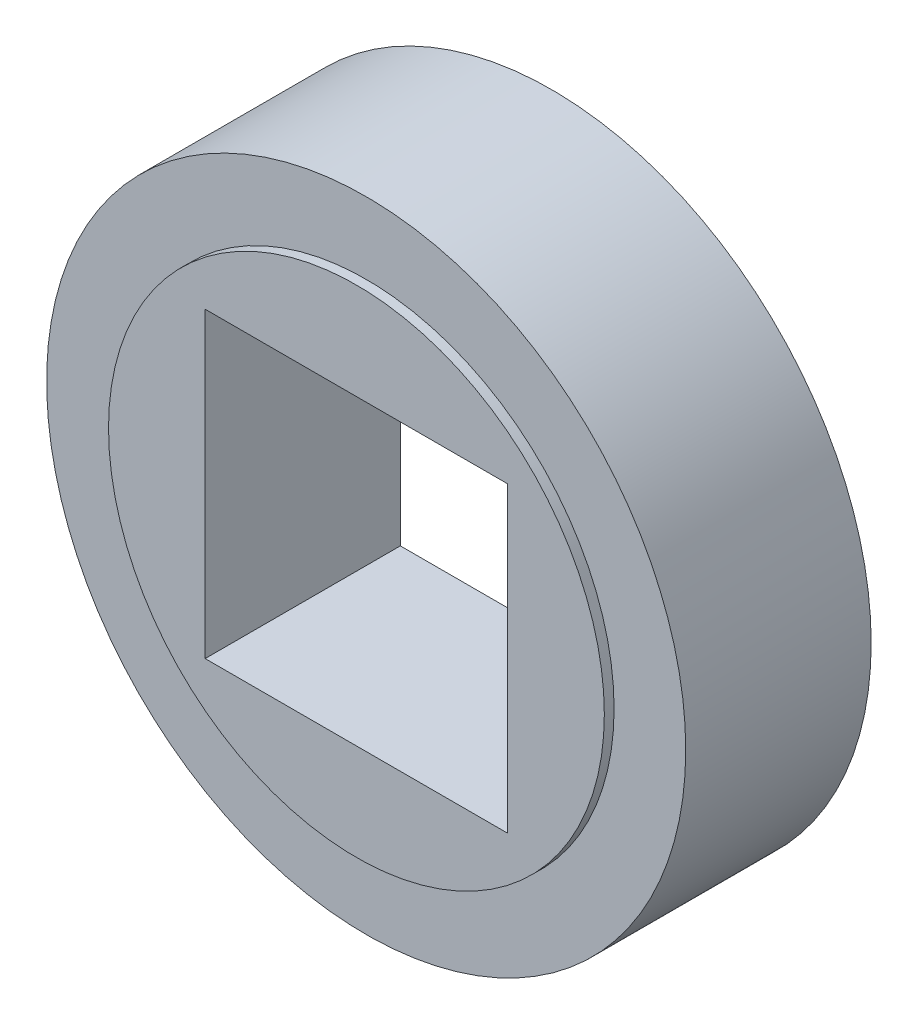
ISO-10303-21;
HEADER;
FILE_DESCRIPTION(('STEP AP214'),'2;1');
FILE_NAME('part.step','',(''),(''),'','','');
FILE_SCHEMA(('AUTOMOTIVE_DESIGN { 1 0 10303 214 1 1 1 1 }'));
ENDSEC;
DATA;
#1=APPLICATION_CONTEXT('core data for automotive mechanical design processes');
#2=APPLICATION_PROTOCOL_DEFINITION('international standard','automotive_design',2000,#1);
#3=PRODUCT_CONTEXT('',#1,'mechanical');
#4=PRODUCT('Part','Part','',(#3));
#5=PRODUCT_RELATED_PRODUCT_CATEGORY('part','',(#4));
#6=PRODUCT_DEFINITION_FORMATION('','',#4);
#7=PRODUCT_DEFINITION_CONTEXT('part definition',#1,'design');
#8=PRODUCT_DEFINITION('design','',#6,#7);
#9=PRODUCT_DEFINITION_SHAPE('','',#8);
#10=(LENGTH_UNIT() NAMED_UNIT(*) SI_UNIT(.MILLI.,.METRE.));
#11=(NAMED_UNIT(*) PLANE_ANGLE_UNIT() SI_UNIT($,.RADIAN.));
#12=(NAMED_UNIT(*) SI_UNIT($,.STERADIAN.) SOLID_ANGLE_UNIT());
#13=UNCERTAINTY_MEASURE_WITH_UNIT(LENGTH_MEASURE(1.E-05),#10,'distance_accuracy_value','');
#14=(GEOMETRIC_REPRESENTATION_CONTEXT(3) GLOBAL_UNCERTAINTY_ASSIGNED_CONTEXT((#13)) GLOBAL_UNIT_ASSIGNED_CONTEXT((#10,
#11,#12)) REPRESENTATION_CONTEXT('',''));
#15=CARTESIAN_POINT('',(0.,0.,0.));
#16=DIRECTION('',(0.,0.,1.));
#17=DIRECTION('',(1.,0.,0.));
#18=AXIS2_PLACEMENT_3D('',#15,#16,#17);
#19=CARTESIAN_POINT('',(0.,0.,20.));
#20=DIRECTION('',(0.,0.,1.));
#21=DIRECTION('',(1.,0.,0.));
#22=AXIS2_PLACEMENT_3D('',#19,#20,#21);
#23=PLANE('',#22);
#24=DIRECTION('',(1.,0.,0.));
#25=VECTOR('',#24,1.);
#26=CARTESIAN_POINT('',(15.5,-15.5,20.));
#27=LINE('',#26,#25);
#28=CARTESIAN_POINT('',(-15.5,-15.5,20.));
#29=VERTEX_POINT('',#28);
#30=CARTESIAN_POINT('',(15.5,-15.5,20.));
#31=VERTEX_POINT('',#30);
#32=EDGE_CURVE('E91',#29,#31,#27,.T.);
#33=ORIENTED_EDGE('',*,*,#32,.F.);
#34=DIRECTION('',(0.,-1.,0.));
#35=VECTOR('',#34,1.);
#36=CARTESIAN_POINT('',(-15.5,-15.5,20.));
#37=LINE('',#36,#35);
#38=CARTESIAN_POINT('',(-15.5,15.5,20.));
#39=VERTEX_POINT('',#38);
#40=EDGE_CURVE('E83',#39,#29,#37,.T.);
#41=ORIENTED_EDGE('',*,*,#40,.F.);
#42=DIRECTION('',(-1.,0.,0.));
#43=VECTOR('',#42,1.);
#44=CARTESIAN_POINT('',(15.5,15.5,20.));
#45=LINE('',#44,#43);
#46=CARTESIAN_POINT('',(15.5,15.5,20.));
#47=VERTEX_POINT('',#46);
#48=EDGE_CURVE('E107',#47,#39,#45,.T.);
#49=ORIENTED_EDGE('',*,*,#48,.F.);
#50=DIRECTION('',(0.,1.,0.));
#51=VECTOR('',#50,1.);
#52=CARTESIAN_POINT('',(15.5,-15.5,20.));
#53=LINE('',#52,#51);
#54=EDGE_CURVE('E103',#31,#47,#53,.T.);
#55=ORIENTED_EDGE('',*,*,#54,.F.);
#56=EDGE_LOOP('',(#33,#41,#49,#55));
#57=FACE_BOUND('',#56,.T.);
#58=CARTESIAN_POINT('',(0.,0.,20.));
#59=DIRECTION('',(0.,0.,1.));
#60=DIRECTION('',(1.,0.,0.));
#61=AXIS2_PLACEMENT_3D('',#58,#59,#60);
#62=CIRCLE('',#61,25.4);
#63=CARTESIAN_POINT('',(25.4,0.,20.));
#64=VERTEX_POINT('',#63);
#65=EDGE_CURVE('E169',#64,#64,#62,.T.);
#66=ORIENTED_EDGE('',*,*,#65,.T.);
#67=EDGE_LOOP('',(#66));
#68=FACE_BOUND('',#67,.T.);
#69=ADVANCED_FACE('F41',(#57,#68),#23,.T.);
#70=CARTESIAN_POINT('',(0.,0.,20.));
#71=DIRECTION('',(0.,0.,-1.));
#72=DIRECTION('',(-1.,0.,0.));
#73=AXIS2_PLACEMENT_3D('',#70,#71,#72);
#74=CYLINDRICAL_SURFACE('',#73,32.7406);
#75=CARTESIAN_POINT('',(0.,0.,0.));
#76=DIRECTION('',(0.,0.,1.));
#77=DIRECTION('',(1.,0.,0.));
#78=AXIS2_PLACEMENT_3D('',#75,#76,#77);
#79=CIRCLE('',#78,32.7406);
#80=CARTESIAN_POINT('',(32.7406,0.,0.));
#81=VERTEX_POINT('',#80);
#82=EDGE_CURVE('E11',#81,#81,#79,.T.);
#83=ORIENTED_EDGE('',*,*,#82,.T.);
#84=EDGE_LOOP('',(#83));
#85=FACE_BOUND('',#84,.T.);
#86=CARTESIAN_POINT('',(0.,0.,19.));
#87=DIRECTION('',(0.,0.,1.));
#88=DIRECTION('',(1.,0.,0.));
#89=AXIS2_PLACEMENT_3D('',#86,#87,#88);
#90=CIRCLE('',#89,32.7406);
#91=CARTESIAN_POINT('',(32.7406,0.,19.));
#92=VERTEX_POINT('',#91);
#93=EDGE_CURVE('E115',#92,#92,#90,.T.);
#94=ORIENTED_EDGE('',*,*,#93,.F.);
#95=EDGE_LOOP('',(#94));
#96=FACE_BOUND('',#95,.T.);
#97=ADVANCED_FACE('F43',(#85,#96),#74,.T.);
#98=CARTESIAN_POINT('',(0.,0.,0.));
#99=DIRECTION('',(0.,0.,1.));
#100=DIRECTION('',(1.,0.,0.));
#101=AXIS2_PLACEMENT_3D('',#98,#99,#100);
#102=PLANE('',#101);
#103=ORIENTED_EDGE('',*,*,#82,.F.);
#104=EDGE_LOOP('',(#103));
#105=FACE_BOUND('',#104,.T.);
#106=DIRECTION('',(0.,-1.,0.));
#107=VECTOR('',#106,1.);
#108=CARTESIAN_POINT('',(-15.5,-15.5,0.));
#109=LINE('',#108,#107);
#110=CARTESIAN_POINT('',(-15.5,15.5,0.));
#111=VERTEX_POINT('',#110);
#112=CARTESIAN_POINT('',(-15.5,-15.5,0.));
#113=VERTEX_POINT('',#112);
#114=EDGE_CURVE('E65',#111,#113,#109,.T.);
#115=ORIENTED_EDGE('',*,*,#114,.T.);
#116=DIRECTION('',(1.,0.,0.));
#117=VECTOR('',#116,1.);
#118=CARTESIAN_POINT('',(15.5,-15.5,0.));
#119=LINE('',#118,#117);
#120=CARTESIAN_POINT('',(15.5,-15.5,0.));
#121=VERTEX_POINT('',#120);
#122=EDGE_CURVE('E98',#113,#121,#119,.T.);
#123=ORIENTED_EDGE('',*,*,#122,.T.);
#124=DIRECTION('',(0.,1.,0.));
#125=VECTOR('',#124,1.);
#126=CARTESIAN_POINT('',(15.5,-15.5,0.));
#127=LINE('',#126,#125);
#128=CARTESIAN_POINT('',(15.5,15.5,0.));
#129=VERTEX_POINT('',#128);
#130=EDGE_CURVE('E118',#121,#129,#127,.T.);
#131=ORIENTED_EDGE('',*,*,#130,.T.);
#132=DIRECTION('',(-1.,0.,0.));
#133=VECTOR('',#132,1.);
#134=CARTESIAN_POINT('',(15.5,15.5,0.));
#135=LINE('',#134,#133);
#136=EDGE_CURVE('E92',#129,#111,#135,.T.);
#137=ORIENTED_EDGE('',*,*,#136,.T.);
#138=EDGE_LOOP('',(#115,#123,#131,#137));
#139=FACE_BOUND('',#138,.T.);
#140=ADVANCED_FACE('F134',(#105,#139),#102,.F.);
#141=CARTESIAN_POINT('',(-15.5,-15.5,20.));
#142=DIRECTION('',(1.,0.,0.));
#143=DIRECTION('',(0.,0.,-1.));
#144=AXIS2_PLACEMENT_3D('',#141,#142,#143);
#145=PLANE('',#144);
#146=ORIENTED_EDGE('',*,*,#114,.F.);
#147=DIRECTION('',(0.,0.,-1.));
#148=VECTOR('',#147,1.);
#149=CARTESIAN_POINT('',(-15.5,15.5,20.));
#150=LINE('',#149,#148);
#151=EDGE_CURVE('E86',#39,#111,#150,.T.);
#152=ORIENTED_EDGE('',*,*,#151,.F.);
#153=ORIENTED_EDGE('',*,*,#40,.T.);
#154=DIRECTION('',(0.,0.,-1.));
#155=VECTOR('',#154,1.);
#156=CARTESIAN_POINT('',(-15.5,-15.5,20.));
#157=LINE('',#156,#155);
#158=EDGE_CURVE('E50',#29,#113,#157,.T.);
#159=ORIENTED_EDGE('',*,*,#158,.T.);
#160=EDGE_LOOP('',(#146,#152,#153,#159));
#161=FACE_BOUND('',#160,.T.);
#162=ADVANCED_FACE('F85',(#161),#145,.T.);
#163=CARTESIAN_POINT('',(15.5,-15.5,20.));
#164=DIRECTION('',(0.,1.,0.));
#165=DIRECTION('',(-1.,0.,0.));
#166=AXIS2_PLACEMENT_3D('',#163,#164,#165);
#167=PLANE('',#166);
#168=ORIENTED_EDGE('',*,*,#122,.F.);
#169=ORIENTED_EDGE('',*,*,#158,.F.);
#170=ORIENTED_EDGE('',*,*,#32,.T.);
#171=DIRECTION('',(0.,0.,-1.));
#172=VECTOR('',#171,1.);
#173=CARTESIAN_POINT('',(15.5,-15.5,20.));
#174=LINE('',#173,#172);
#175=EDGE_CURVE('E100',#31,#121,#174,.T.);
#176=ORIENTED_EDGE('',*,*,#175,.T.);
#177=EDGE_LOOP('',(#168,#169,#170,#176));
#178=FACE_BOUND('',#177,.T.);
#179=ADVANCED_FACE('F95',(#178),#167,.T.);
#180=CARTESIAN_POINT('',(15.5,-15.5,20.));
#181=DIRECTION('',(-1.,0.,0.));
#182=DIRECTION('',(0.,0.,1.));
#183=AXIS2_PLACEMENT_3D('',#180,#181,#182);
#184=PLANE('',#183);
#185=ORIENTED_EDGE('',*,*,#130,.F.);
#186=ORIENTED_EDGE('',*,*,#175,.F.);
#187=ORIENTED_EDGE('',*,*,#54,.T.);
#188=DIRECTION('',(0.,0.,-1.));
#189=VECTOR('',#188,1.);
#190=CARTESIAN_POINT('',(15.5,15.5,20.));
#191=LINE('',#190,#189);
#192=EDGE_CURVE('E57',#47,#129,#191,.T.);
#193=ORIENTED_EDGE('',*,*,#192,.T.);
#194=EDGE_LOOP('',(#185,#186,#187,#193));
#195=FACE_BOUND('',#194,.T.);
#196=ADVANCED_FACE('F132',(#195),#184,.T.);
#197=CARTESIAN_POINT('',(15.5,15.5,20.));
#198=DIRECTION('',(0.,-1.,0.));
#199=DIRECTION('',(1.,0.,0.));
#200=AXIS2_PLACEMENT_3D('',#197,#198,#199);
#201=PLANE('',#200);
#202=ORIENTED_EDGE('',*,*,#136,.F.);
#203=ORIENTED_EDGE('',*,*,#192,.F.);
#204=ORIENTED_EDGE('',*,*,#48,.T.);
#205=ORIENTED_EDGE('',*,*,#151,.T.);
#206=EDGE_LOOP('',(#202,#203,#204,#205));
#207=FACE_BOUND('',#206,.T.);
#208=ADVANCED_FACE('F135',(#207),#201,.T.);
#209=CARTESIAN_POINT('',(0.,0.,19.));
#210=DIRECTION('',(0.,0.,1.));
#211=DIRECTION('',(1.,0.,0.));
#212=AXIS2_PLACEMENT_3D('',#209,#210,#211);
#213=PLANE('',#212);
#214=CARTESIAN_POINT('',(0.,0.,19.));
#215=DIRECTION('',(0.,0.,1.));
#216=DIRECTION('',(1.,0.,0.));
#217=AXIS2_PLACEMENT_3D('',#214,#215,#216);
#218=CIRCLE('',#217,25.4);
#219=CARTESIAN_POINT('',(25.4,0.,19.));
#220=VERTEX_POINT('',#219);
#221=EDGE_CURVE('E166',#220,#220,#218,.T.);
#222=ORIENTED_EDGE('',*,*,#221,.F.);
#223=EDGE_LOOP('',(#222));
#224=FACE_BOUND('',#223,.T.);
#225=ORIENTED_EDGE('',*,*,#93,.T.);
#226=EDGE_LOOP('',(#225));
#227=FACE_BOUND('',#226,.T.);
#228=ADVANCED_FACE('F137',(#224,#227),#213,.T.);
#229=CARTESIAN_POINT('',(0.,0.,19.));
#230=DIRECTION('',(0.,0.,1.));
#231=DIRECTION('',(1.,0.,0.));
#232=AXIS2_PLACEMENT_3D('',#229,#230,#231);
#233=CYLINDRICAL_SURFACE('',#232,25.4);
#234=ORIENTED_EDGE('',*,*,#221,.T.);
#235=EDGE_LOOP('',(#234));
#236=FACE_BOUND('',#235,.T.);
#237=ORIENTED_EDGE('',*,*,#65,.F.);
#238=EDGE_LOOP('',(#237));
#239=FACE_BOUND('',#238,.T.);
#240=ADVANCED_FACE('F143',(#236,#239),#233,.T.);
#241=CLOSED_SHELL('',(#69,#97,#140,#162,#179,#196,#208,#228,#240));
#242=MANIFOLD_SOLID_BREP('B2',#241);
#243=ADVANCED_BREP_SHAPE_REPRESENTATION('',(#18,#242),#14);
#244=SHAPE_DEFINITION_REPRESENTATION(#9,#243);
ENDSEC;
END-ISO-10303-21;
